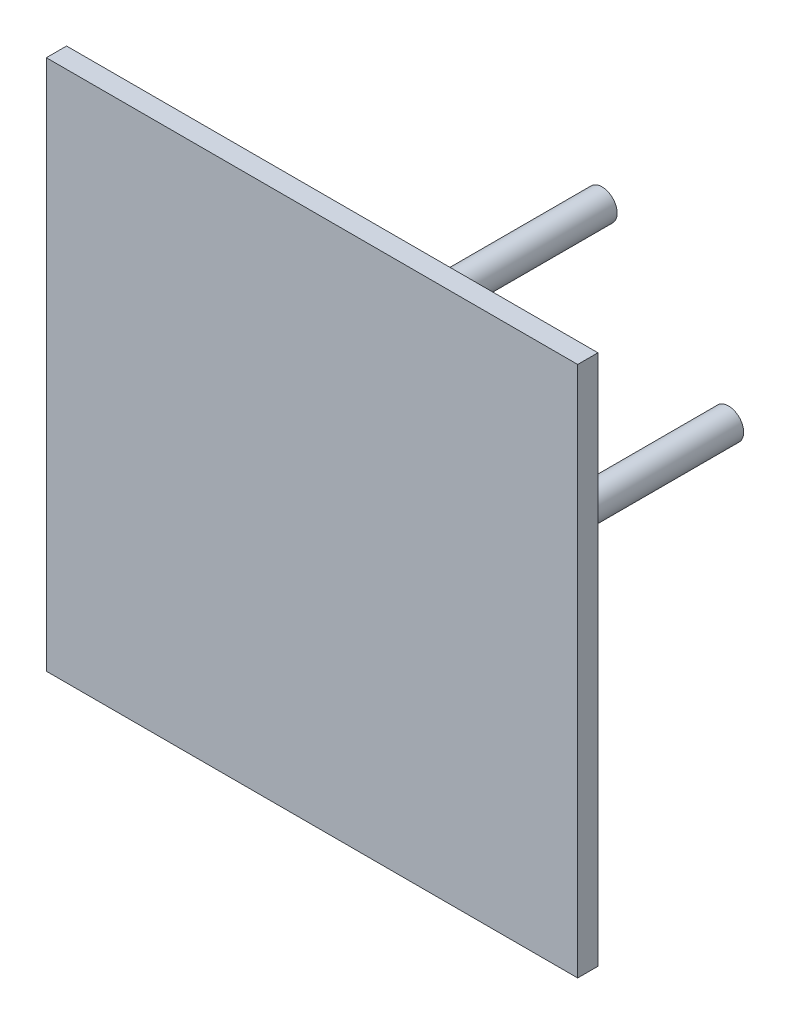
ISO-10303-21;
HEADER;
FILE_DESCRIPTION(('STEP AP214'),'2;1');
FILE_NAME('part.step','',(''),(''),'','','');
FILE_SCHEMA(('AUTOMOTIVE_DESIGN { 1 0 10303 214 1 1 1 1 }'));
ENDSEC;
DATA;
#1=APPLICATION_CONTEXT('core data for automotive mechanical design processes');
#2=APPLICATION_PROTOCOL_DEFINITION('international standard','automotive_design',2000,#1);
#3=PRODUCT_CONTEXT('',#1,'mechanical');
#4=PRODUCT('Part','Part','',(#3));
#5=PRODUCT_RELATED_PRODUCT_CATEGORY('part','',(#4));
#6=PRODUCT_DEFINITION_FORMATION('','',#4);
#7=PRODUCT_DEFINITION_CONTEXT('part definition',#1,'design');
#8=PRODUCT_DEFINITION('design','',#6,#7);
#9=PRODUCT_DEFINITION_SHAPE('','',#8);
#10=(LENGTH_UNIT() NAMED_UNIT(*) SI_UNIT(.MILLI.,.METRE.));
#11=(NAMED_UNIT(*) PLANE_ANGLE_UNIT() SI_UNIT($,.RADIAN.));
#12=(NAMED_UNIT(*) SI_UNIT($,.STERADIAN.) SOLID_ANGLE_UNIT());
#13=UNCERTAINTY_MEASURE_WITH_UNIT(LENGTH_MEASURE(1.E-05),#10,'distance_accuracy_value','');
#14=(GEOMETRIC_REPRESENTATION_CONTEXT(3) GLOBAL_UNCERTAINTY_ASSIGNED_CONTEXT((#13)) GLOBAL_UNIT_ASSIGNED_CONTEXT((#10,
#11,#12)) REPRESENTATION_CONTEXT('',''));
#15=CARTESIAN_POINT('',(0.,0.,0.));
#16=DIRECTION('',(0.,0.,1.));
#17=DIRECTION('',(1.,0.,0.));
#18=AXIS2_PLACEMENT_3D('',#15,#16,#17);
#19=CARTESIAN_POINT('',(77.5,52.5,-53.3));
#20=DIRECTION('',(0.,0.,-1.));
#21=DIRECTION('',(-1.,0.,0.));
#22=AXIS2_PLACEMENT_3D('',#19,#20,#21);
#23=PLANE('',#22);
#24=CARTESIAN_POINT('',(77.5,52.5,-53.3));
#25=DIRECTION('',(0.,0.,1.));
#26=DIRECTION('',(1.,0.,0.));
#27=AXIS2_PLACEMENT_3D('',#24,#25,#26);
#28=CIRCLE('',#27,3.);
#29=CARTESIAN_POINT('',(80.5,52.5,-53.3));
#30=VERTEX_POINT('',#29);
#31=EDGE_CURVE('E188',#30,#30,#28,.T.);
#32=ORIENTED_EDGE('',*,*,#31,.F.);
#33=EDGE_LOOP('',(#32));
#34=FACE_BOUND('',#33,.T.);
#35=ADVANCED_FACE('F17',(#34),#23,.T.);
#36=CARTESIAN_POINT('',(52.5,27.5,-53.3));
#37=DIRECTION('',(0.,0.,-1.));
#38=DIRECTION('',(-1.,0.,0.));
#39=AXIS2_PLACEMENT_3D('',#36,#37,#38);
#40=PLANE('',#39);
#41=CARTESIAN_POINT('',(52.5,27.5,-53.3));
#42=DIRECTION('',(0.,0.,1.));
#43=DIRECTION('',(1.,0.,0.));
#44=AXIS2_PLACEMENT_3D('',#41,#42,#43);
#45=CIRCLE('',#44,3.);
#46=CARTESIAN_POINT('',(55.5,27.5,-53.3));
#47=VERTEX_POINT('',#46);
#48=EDGE_CURVE('E238',#47,#47,#45,.T.);
#49=ORIENTED_EDGE('',*,*,#48,.F.);
#50=EDGE_LOOP('',(#49));
#51=FACE_BOUND('',#50,.T.);
#52=ADVANCED_FACE('F246',(#51),#40,.T.);
#53=CARTESIAN_POINT('',(27.5,52.5,-53.3));
#54=DIRECTION('',(0.,0.,-1.));
#55=DIRECTION('',(-1.,0.,0.));
#56=AXIS2_PLACEMENT_3D('',#53,#54,#55);
#57=PLANE('',#56);
#58=CARTESIAN_POINT('',(27.5,52.5,-53.3));
#59=DIRECTION('',(0.,0.,1.));
#60=DIRECTION('',(1.,0.,0.));
#61=AXIS2_PLACEMENT_3D('',#58,#59,#60);
#62=CIRCLE('',#61,2.99999999999999);
#63=CARTESIAN_POINT('',(30.5,52.5,-53.3));
#64=VERTEX_POINT('',#63);
#65=EDGE_CURVE('E235',#64,#64,#62,.T.);
#66=ORIENTED_EDGE('',*,*,#65,.F.);
#67=EDGE_LOOP('',(#66));
#68=FACE_BOUND('',#67,.T.);
#69=ADVANCED_FACE('F250',(#68),#57,.T.);
#70=CARTESIAN_POINT('',(52.5,77.5,-53.3));
#71=DIRECTION('',(0.,0.,-1.));
#72=DIRECTION('',(-1.,0.,0.));
#73=AXIS2_PLACEMENT_3D('',#70,#71,#72);
#74=PLANE('',#73);
#75=CARTESIAN_POINT('',(52.5,77.5,-53.3));
#76=DIRECTION('',(0.,0.,1.));
#77=DIRECTION('',(1.,0.,0.));
#78=AXIS2_PLACEMENT_3D('',#75,#76,#77);
#79=CIRCLE('',#78,3.);
#80=CARTESIAN_POINT('',(55.5,77.5,-53.3));
#81=VERTEX_POINT('',#80);
#82=EDGE_CURVE('E232',#81,#81,#79,.T.);
#83=ORIENTED_EDGE('',*,*,#82,.F.);
#84=EDGE_LOOP('',(#83));
#85=FACE_BOUND('',#84,.T.);
#86=ADVANCED_FACE('F347',(#85),#74,.T.);
#87=CARTESIAN_POINT('',(52.5,52.5,2.));
#88=DIRECTION('',(0.,0.,-1.));
#89=DIRECTION('',(-1.,0.,0.));
#90=AXIS2_PLACEMENT_3D('',#87,#88,#89);
#91=PLANE('',#90);
#92=CARTESIAN_POINT('',(52.5,52.5,2.));
#93=DIRECTION('',(0.,0.,-1.));
#94=DIRECTION('',(-1.,0.,0.));
#95=AXIS2_PLACEMENT_3D('',#92,#93,#94);
#96=CIRCLE('',#95,3.);
#97=CARTESIAN_POINT('',(49.5,52.5,2.));
#98=VERTEX_POINT('',#97);
#99=EDGE_CURVE('E229',#98,#98,#96,.T.);
#100=ORIENTED_EDGE('',*,*,#99,.T.);
#101=EDGE_LOOP('',(#100));
#102=FACE_BOUND('',#101,.T.);
#103=ADVANCED_FACE('F344',(#102),#91,.T.);
#104=CARTESIAN_POINT('',(41.,52.5,-11.));
#105=DIRECTION('',(0.,-1.,0.));
#106=DIRECTION('',(0.,0.,-1.));
#107=AXIS2_PLACEMENT_3D('',#104,#105,#106);
#108=CYLINDRICAL_SURFACE('',#107,1.);
#109=CARTESIAN_POINT('',(41.,52.,-11.));
#110=DIRECTION('',(0.,-1.,0.));
#111=DIRECTION('',(0.,0.,-1.));
#112=AXIS2_PLACEMENT_3D('',#109,#110,#111);
#113=CIRCLE('',#112,1.);
#114=CARTESIAN_POINT('',(40.,52.,-11.));
#115=VERTEX_POINT('',#114);
#116=CARTESIAN_POINT('',(41.,52.,-12.));
#117=VERTEX_POINT('',#116);
#118=EDGE_CURVE('E163',#115,#117,#113,.T.);
#119=ORIENTED_EDGE('',*,*,#118,.T.);
#120=DIRECTION('',(0.,1.,0.));
#121=VECTOR('',#120,1.);
#122=CARTESIAN_POINT('',(41.,52.5,-12.));
#123=LINE('',#122,#121);
#124=CARTESIAN_POINT('',(41.,50.,-12.));
#125=VERTEX_POINT('',#124);
#126=EDGE_CURVE('E123',#125,#117,#123,.T.);
#127=ORIENTED_EDGE('',*,*,#126,.F.);
#128=CARTESIAN_POINT('',(41.,50.,-11.));
#129=DIRECTION('',(0.,-1.,0.));
#130=DIRECTION('',(0.,0.,-1.));
#131=AXIS2_PLACEMENT_3D('',#128,#129,#130);
#132=CIRCLE('',#131,1.);
#133=CARTESIAN_POINT('',(40.,50.,-11.));
#134=VERTEX_POINT('',#133);
#135=EDGE_CURVE('E20',#125,#134,#132,.F.);
#136=ORIENTED_EDGE('',*,*,#135,.T.);
#137=DIRECTION('',(0.,1.,0.));
#138=VECTOR('',#137,1.);
#139=CARTESIAN_POINT('',(40.,50.,-11.));
#140=LINE('',#139,#138);
#141=EDGE_CURVE('E122',#134,#115,#140,.T.);
#142=ORIENTED_EDGE('',*,*,#141,.T.);
#143=EDGE_LOOP('',(#119,#127,#136,#142));
#144=FACE_BOUND('',#143,.T.);
#145=ADVANCED_FACE('F121',(#144),#108,.T.);
#146=CARTESIAN_POINT('',(43.25,43.,-6.));
#147=DIRECTION('',(0.,1.,0.));
#148=DIRECTION('',(0.,0.,1.));
#149=AXIS2_PLACEMENT_3D('',#146,#147,#148);
#150=CYLINDRICAL_SURFACE('',#149,1.99870195498223);
#151=CARTESIAN_POINT('',(43.25,50.,-6.));
#152=DIRECTION('',(0.,1.,0.));
#153=DIRECTION('',(0.,0.,1.));
#154=AXIS2_PLACEMENT_3D('',#151,#152,#153);
#155=CIRCLE('',#154,1.99870195498223);
#156=CARTESIAN_POINT('',(43.25,50.,-4.00129804501777));
#157=VERTEX_POINT('',#156);
#158=EDGE_CURVE('E147',#157,#157,#155,.F.);
#159=ORIENTED_EDGE('',*,*,#158,.T.);
#160=EDGE_LOOP('',(#159));
#161=FACE_BOUND('',#160,.T.);
#162=CARTESIAN_POINT('',(43.25,52.,-6.));
#163=DIRECTION('',(0.,1.,0.));
#164=DIRECTION('',(0.,0.,1.));
#165=AXIS2_PLACEMENT_3D('',#162,#163,#164);
#166=CIRCLE('',#165,1.99870195498223);
#167=CARTESIAN_POINT('',(43.25,52.,-4.00129804501777));
#168=VERTEX_POINT('',#167);
#169=EDGE_CURVE('E167',#168,#168,#166,.T.);
#170=ORIENTED_EDGE('',*,*,#169,.T.);
#171=EDGE_LOOP('',(#170));
#172=FACE_BOUND('',#171,.T.);
#173=ADVANCED_FACE('F337',(#161,#172),#150,.F.);
#174=CARTESIAN_POINT('',(43.25,43.,-6.));
#175=DIRECTION('',(0.,1.,0.));
#176=DIRECTION('',(0.,0.,1.));
#177=AXIS2_PLACEMENT_3D('',#174,#175,#176);
#178=CYLINDRICAL_SURFACE('',#177,1.99870195498223);
#179=CARTESIAN_POINT('',(43.25,53.,-6.));
#180=DIRECTION('',(0.,1.,0.));
#181=DIRECTION('',(0.,0.,1.));
#182=AXIS2_PLACEMENT_3D('',#179,#180,#181);
#183=CIRCLE('',#182,1.99870195498223);
#184=CARTESIAN_POINT('',(43.25,53.,-4.00129804501777));
#185=VERTEX_POINT('',#184);
#186=EDGE_CURVE('E176',#185,#185,#183,.F.);
#187=ORIENTED_EDGE('',*,*,#186,.T.);
#188=EDGE_LOOP('',(#187));
#189=FACE_BOUND('',#188,.T.);
#190=CARTESIAN_POINT('',(43.25,55.,-6.));
#191=DIRECTION('',(0.,1.,0.));
#192=DIRECTION('',(0.,0.,1.));
#193=AXIS2_PLACEMENT_3D('',#190,#191,#192);
#194=CIRCLE('',#193,1.99870195498223);
#195=CARTESIAN_POINT('',(43.25,55.,-4.00129804501777));
#196=VERTEX_POINT('',#195);
#197=EDGE_CURVE('E216',#196,#196,#194,.T.);
#198=ORIENTED_EDGE('',*,*,#197,.T.);
#199=EDGE_LOOP('',(#198));
#200=FACE_BOUND('',#199,.T.);
#201=ADVANCED_FACE('F333',(#189,#200),#178,.F.);
#202=CARTESIAN_POINT('',(52.5,52.5,-12.));
#203=DIRECTION('',(0.,0.,-1.));
#204=DIRECTION('',(-1.,0.,0.));
#205=AXIS2_PLACEMENT_3D('',#202,#203,#204);
#206=PLANE('',#205);
#207=CARTESIAN_POINT('',(52.5,52.5,-12.));
#208=DIRECTION('',(0.,0.,1.));
#209=DIRECTION('',(1.,0.,0.));
#210=AXIS2_PLACEMENT_3D('',#207,#208,#209);
#211=CIRCLE('',#210,6.50000000000001);
#212=CARTESIAN_POINT('',(46.5,50.,-12.));
#213=VERTEX_POINT('',#212);
#214=CARTESIAN_POINT('',(46.5,55.,-12.));
#215=VERTEX_POINT('',#214);
#216=EDGE_CURVE('E145',#213,#215,#211,.T.);
#217=ORIENTED_EDGE('',*,*,#216,.F.);
#218=DIRECTION('',(1.,0.,0.));
#219=VECTOR('',#218,1.);
#220=CARTESIAN_POINT('',(46.5,50.,-12.));
#221=LINE('',#220,#219);
#222=EDGE_CURVE('E142',#213,#125,#221,.F.);
#223=ORIENTED_EDGE('',*,*,#222,.T.);
#224=ORIENTED_EDGE('',*,*,#126,.T.);
#225=DIRECTION('',(1.,0.,0.));
#226=VECTOR('',#225,1.);
#227=CARTESIAN_POINT('',(49.4405882918443,52.,-12.));
#228=LINE('',#227,#226);
#229=CARTESIAN_POINT('',(49.4405882918443,52.,-12.));
#230=VERTEX_POINT('',#229);
#231=EDGE_CURVE('E134',#117,#230,#228,.T.);
#232=ORIENTED_EDGE('',*,*,#231,.T.);
#233=CARTESIAN_POINT('',(52.5,52.5,-12.));
#234=DIRECTION('',(0.,0.,1.));
#235=DIRECTION('',(1.,0.,0.));
#236=AXIS2_PLACEMENT_3D('',#233,#234,#235);
#237=CIRCLE('',#236,3.09999999999999);
#238=CARTESIAN_POINT('',(49.4405882918443,53.,-12.));
#239=VERTEX_POINT('',#238);
#240=EDGE_CURVE('E171',#230,#239,#237,.T.);
#241=ORIENTED_EDGE('',*,*,#240,.T.);
#242=DIRECTION('',(1.,0.,0.));
#243=VECTOR('',#242,1.);
#244=CARTESIAN_POINT('',(49.4405882918443,53.,-12.));
#245=LINE('',#244,#243);
#246=CARTESIAN_POINT('',(41.,53.,-12.));
#247=VERTEX_POINT('',#246);
#248=EDGE_CURVE('E173',#239,#247,#245,.F.);
#249=ORIENTED_EDGE('',*,*,#248,.T.);
#250=DIRECTION('',(0.,-1.,0.));
#251=VECTOR('',#250,1.);
#252=CARTESIAN_POINT('',(41.,52.5,-12.));
#253=LINE('',#252,#251);
#254=CARTESIAN_POINT('',(41.,55.,-12.));
#255=VERTEX_POINT('',#254);
#256=EDGE_CURVE('E187',#255,#247,#253,.T.);
#257=ORIENTED_EDGE('',*,*,#256,.F.);
#258=DIRECTION('',(1.,0.,0.));
#259=VECTOR('',#258,1.);
#260=CARTESIAN_POINT('',(46.5,55.,-12.));
#261=LINE('',#260,#259);
#262=EDGE_CURVE('E181',#255,#215,#261,.T.);
#263=ORIENTED_EDGE('',*,*,#262,.T.);
#264=EDGE_LOOP('',(#217,#223,#224,#232,#241,#249,#257,#263));
#265=FACE_BOUND('',#264,.T.);
#266=ADVANCED_FACE('F329',(#265),#206,.T.);
#267=CARTESIAN_POINT('',(41.,52.5,-11.));
#268=DIRECTION('',(0.,-1.,0.));
#269=DIRECTION('',(1.,0.,0.));
#270=AXIS2_PLACEMENT_3D('',#267,#268,#269);
#271=CYLINDRICAL_SURFACE('',#270,1.);
#272=CARTESIAN_POINT('',(41.,55.,-11.));
#273=DIRECTION('',(0.,-1.,0.));
#274=DIRECTION('',(1.,0.,0.));
#275=AXIS2_PLACEMENT_3D('',#272,#273,#274);
#276=CIRCLE('',#275,1.);
#277=CARTESIAN_POINT('',(40.,55.,-11.));
#278=VERTEX_POINT('',#277);
#279=EDGE_CURVE('E212',#278,#255,#276,.T.);
#280=ORIENTED_EDGE('',*,*,#279,.T.);
#281=ORIENTED_EDGE('',*,*,#256,.T.);
#282=CARTESIAN_POINT('',(41.,53.,-11.));
#283=DIRECTION('',(0.,-1.,0.));
#284=DIRECTION('',(1.,0.,0.));
#285=AXIS2_PLACEMENT_3D('',#282,#283,#284);
#286=CIRCLE('',#285,1.);
#287=CARTESIAN_POINT('',(40.,53.,-11.));
#288=VERTEX_POINT('',#287);
#289=EDGE_CURVE('E172',#247,#288,#286,.F.);
#290=ORIENTED_EDGE('',*,*,#289,.T.);
#291=DIRECTION('',(0.,1.,0.));
#292=VECTOR('',#291,1.);
#293=CARTESIAN_POINT('',(40.,55.,-11.));
#294=LINE('',#293,#292);
#295=EDGE_CURVE('E180',#288,#278,#294,.T.);
#296=ORIENTED_EDGE('',*,*,#295,.T.);
#297=EDGE_LOOP('',(#280,#281,#290,#296));
#298=FACE_BOUND('',#297,.T.);
#299=ADVANCED_FACE('F325',(#298),#271,.T.);
#300=CARTESIAN_POINT('',(77.5,52.5,-53.3));
#301=DIRECTION('',(0.,0.,1.));
#302=DIRECTION('',(1.,0.,0.));
#303=AXIS2_PLACEMENT_3D('',#300,#301,#302);
#304=CYLINDRICAL_SURFACE('',#303,3.);
#305=CARTESIAN_POINT('',(77.5,52.5,0.));
#306=DIRECTION('',(0.,0.,1.));
#307=DIRECTION('',(1.,0.,0.));
#308=AXIS2_PLACEMENT_3D('',#305,#306,#307);
#309=CIRCLE('',#308,3.);
#310=CARTESIAN_POINT('',(80.5,52.5,0.));
#311=VERTEX_POINT('',#310);
#312=EDGE_CURVE('E209',#311,#311,#309,.T.);
#313=ORIENTED_EDGE('',*,*,#312,.F.);
#314=EDGE_LOOP('',(#313));
#315=FACE_BOUND('',#314,.T.);
#316=ORIENTED_EDGE('',*,*,#31,.T.);
#317=EDGE_LOOP('',(#316));
#318=FACE_BOUND('',#317,.T.);
#319=ADVANCED_FACE('F243',(#315,#318),#304,.T.);
#320=CARTESIAN_POINT('',(52.5,27.5,-53.3));
#321=DIRECTION('',(0.,0.,1.));
#322=DIRECTION('',(1.,0.,0.));
#323=AXIS2_PLACEMENT_3D('',#320,#321,#322);
#324=CYLINDRICAL_SURFACE('',#323,3.);
#325=CARTESIAN_POINT('',(52.5,27.5,0.));
#326=DIRECTION('',(0.,0.,1.));
#327=DIRECTION('',(1.,0.,0.));
#328=AXIS2_PLACEMENT_3D('',#325,#326,#327);
#329=CIRCLE('',#328,3.);
#330=CARTESIAN_POINT('',(55.5,27.5,0.));
#331=VERTEX_POINT('',#330);
#332=EDGE_CURVE('E206',#331,#331,#329,.T.);
#333=ORIENTED_EDGE('',*,*,#332,.F.);
#334=EDGE_LOOP('',(#333));
#335=FACE_BOUND('',#334,.T.);
#336=ORIENTED_EDGE('',*,*,#48,.T.);
#337=EDGE_LOOP('',(#336));
#338=FACE_BOUND('',#337,.T.);
#339=ADVANCED_FACE('F318',(#335,#338),#324,.T.);
#340=CARTESIAN_POINT('',(27.5,52.5,-53.3));
#341=DIRECTION('',(0.,0.,1.));
#342=DIRECTION('',(1.,0.,0.));
#343=AXIS2_PLACEMENT_3D('',#340,#341,#342);
#344=CYLINDRICAL_SURFACE('',#343,2.99999999999999);
#345=CARTESIAN_POINT('',(27.5,52.5,0.));
#346=DIRECTION('',(0.,0.,1.));
#347=DIRECTION('',(1.,0.,0.));
#348=AXIS2_PLACEMENT_3D('',#345,#346,#347);
#349=CIRCLE('',#348,2.99999999999999);
#350=CARTESIAN_POINT('',(30.5,52.5,0.));
#351=VERTEX_POINT('',#350);
#352=EDGE_CURVE('E203',#351,#351,#349,.T.);
#353=ORIENTED_EDGE('',*,*,#352,.F.);
#354=EDGE_LOOP('',(#353));
#355=FACE_BOUND('',#354,.T.);
#356=ORIENTED_EDGE('',*,*,#65,.T.);
#357=EDGE_LOOP('',(#356));
#358=FACE_BOUND('',#357,.T.);
#359=ADVANCED_FACE('F314',(#355,#358),#344,.T.);
#360=CARTESIAN_POINT('',(52.5,77.5,-53.3));
#361=DIRECTION('',(0.,0.,1.));
#362=DIRECTION('',(1.,0.,0.));
#363=AXIS2_PLACEMENT_3D('',#360,#361,#362);
#364=CYLINDRICAL_SURFACE('',#363,3.);
#365=CARTESIAN_POINT('',(52.5,77.5,0.));
#366=DIRECTION('',(0.,0.,1.));
#367=DIRECTION('',(1.,0.,0.));
#368=AXIS2_PLACEMENT_3D('',#365,#366,#367);
#369=CIRCLE('',#368,3.);
#370=CARTESIAN_POINT('',(55.5,77.5,0.));
#371=VERTEX_POINT('',#370);
#372=EDGE_CURVE('E200',#371,#371,#369,.T.);
#373=ORIENTED_EDGE('',*,*,#372,.F.);
#374=EDGE_LOOP('',(#373));
#375=FACE_BOUND('',#374,.T.);
#376=ORIENTED_EDGE('',*,*,#82,.T.);
#377=EDGE_LOOP('',(#376));
#378=FACE_BOUND('',#377,.T.);
#379=ADVANCED_FACE('F310',(#375,#378),#364,.T.);
#380=CARTESIAN_POINT('',(52.5,52.5,2.));
#381=DIRECTION('',(0.,0.,-1.));
#382=DIRECTION('',(-1.,0.,0.));
#383=AXIS2_PLACEMENT_3D('',#380,#381,#382);
#384=CYLINDRICAL_SURFACE('',#383,3.);
#385=CARTESIAN_POINT('',(52.5,52.5,0.));
#386=DIRECTION('',(0.,0.,-1.));
#387=DIRECTION('',(-1.,0.,0.));
#388=AXIS2_PLACEMENT_3D('',#385,#386,#387);
#389=CIRCLE('',#388,3.);
#390=CARTESIAN_POINT('',(49.5,52.5,0.));
#391=VERTEX_POINT('',#390);
#392=EDGE_CURVE('E197',#391,#391,#389,.F.);
#393=ORIENTED_EDGE('',*,*,#392,.F.);
#394=EDGE_LOOP('',(#393));
#395=FACE_BOUND('',#394,.T.);
#396=ORIENTED_EDGE('',*,*,#99,.F.);
#397=EDGE_LOOP('',(#396));
#398=FACE_BOUND('',#397,.T.);
#399=ADVANCED_FACE('F306',(#395,#398),#384,.F.);
#400=CARTESIAN_POINT('',(49.4405882918443,53.,-12.));
#401=DIRECTION('',(0.,1.,0.));
#402=DIRECTION('',(0.,0.,1.));
#403=AXIS2_PLACEMENT_3D('',#400,#401,#402);
#404=PLANE('',#403);
#405=ORIENTED_EDGE('',*,*,#289,.F.);
#406=ORIENTED_EDGE('',*,*,#248,.F.);
#407=DIRECTION('',(0.,0.,1.));
#408=VECTOR('',#407,1.);
#409=CARTESIAN_POINT('',(49.4405882918443,53.,-12.));
#410=LINE('',#409,#408);
#411=CARTESIAN_POINT('',(49.4405882918443,53.,0.));
#412=VERTEX_POINT('',#411);
#413=EDGE_CURVE('E168',#239,#412,#410,.T.);
#414=ORIENTED_EDGE('',*,*,#413,.T.);
#415=DIRECTION('',(-1.,0.,0.));
#416=VECTOR('',#415,1.);
#417=CARTESIAN_POINT('',(0.,53.,0.));
#418=LINE('',#417,#416);
#419=CARTESIAN_POINT('',(40.,53.,0.));
#420=VERTEX_POINT('',#419);
#421=EDGE_CURVE('E196',#420,#412,#418,.F.);
#422=ORIENTED_EDGE('',*,*,#421,.F.);
#423=DIRECTION('',(0.,0.,1.));
#424=VECTOR('',#423,1.);
#425=CARTESIAN_POINT('',(40.,53.,-12.));
#426=LINE('',#425,#424);
#427=EDGE_CURVE('E177',#420,#288,#426,.F.);
#428=ORIENTED_EDGE('',*,*,#427,.T.);
#429=EDGE_LOOP('',(#405,#406,#414,#422,#428));
#430=FACE_BOUND('',#429,.T.);
#431=ORIENTED_EDGE('',*,*,#186,.F.);
#432=EDGE_LOOP('',(#431));
#433=FACE_BOUND('',#432,.T.);
#434=ADVANCED_FACE('F302',(#430,#433),#404,.F.);
#435=CARTESIAN_POINT('',(52.5,52.5,-12.));
#436=DIRECTION('',(0.,0.,1.));
#437=DIRECTION('',(1.,0.,0.));
#438=AXIS2_PLACEMENT_3D('',#435,#436,#437);
#439=CYLINDRICAL_SURFACE('',#438,3.09999999999999);
#440=ORIENTED_EDGE('',*,*,#240,.F.);
#441=DIRECTION('',(0.,0.,-1.));
#442=VECTOR('',#441,1.);
#443=CARTESIAN_POINT('',(49.4405882918443,52.,-12.));
#444=LINE('',#443,#442);
#445=CARTESIAN_POINT('',(49.4405882918443,52.,0.));
#446=VERTEX_POINT('',#445);
#447=EDGE_CURVE('E164',#230,#446,#444,.F.);
#448=ORIENTED_EDGE('',*,*,#447,.T.);
#449=CARTESIAN_POINT('',(52.5,52.5,0.));
#450=DIRECTION('',(0.,0.,1.));
#451=DIRECTION('',(1.,0.,0.));
#452=AXIS2_PLACEMENT_3D('',#449,#450,#451);
#453=CIRCLE('',#452,3.09999999999999);
#454=EDGE_CURVE('E194',#412,#446,#453,.F.);
#455=ORIENTED_EDGE('',*,*,#454,.F.);
#456=ORIENTED_EDGE('',*,*,#413,.F.);
#457=EDGE_LOOP('',(#440,#448,#455,#456));
#458=FACE_BOUND('',#457,.T.);
#459=ADVANCED_FACE('F298',(#458),#439,.F.);
#460=CARTESIAN_POINT('',(49.4405882918443,52.,-12.));
#461=DIRECTION('',(0.,-1.,0.));
#462=DIRECTION('',(0.,0.,-1.));
#463=AXIS2_PLACEMENT_3D('',#460,#461,#462);
#464=PLANE('',#463);
#465=ORIENTED_EDGE('',*,*,#118,.F.);
#466=DIRECTION('',(0.,0.,-1.));
#467=VECTOR('',#466,1.);
#468=CARTESIAN_POINT('',(40.,52.,-12.));
#469=LINE('',#468,#467);
#470=CARTESIAN_POINT('',(40.,52.,0.));
#471=VERTEX_POINT('',#470);
#472=EDGE_CURVE('E133',#115,#471,#469,.F.);
#473=ORIENTED_EDGE('',*,*,#472,.T.);
#474=DIRECTION('',(-1.,0.,0.));
#475=VECTOR('',#474,1.);
#476=CARTESIAN_POINT('',(0.,52.,0.));
#477=LINE('',#476,#475);
#478=EDGE_CURVE('E155',#446,#471,#477,.T.);
#479=ORIENTED_EDGE('',*,*,#478,.F.);
#480=ORIENTED_EDGE('',*,*,#447,.F.);
#481=ORIENTED_EDGE('',*,*,#231,.F.);
#482=EDGE_LOOP('',(#465,#473,#479,#480,#481));
#483=FACE_BOUND('',#482,.T.);
#484=ORIENTED_EDGE('',*,*,#169,.F.);
#485=EDGE_LOOP('',(#484));
#486=FACE_BOUND('',#485,.T.);
#487=ADVANCED_FACE('F295',(#483,#486),#464,.F.);
#488=CARTESIAN_POINT('',(40.,50.,-12.));
#489=DIRECTION('',(1.,0.,0.));
#490=DIRECTION('',(0.,0.,-1.));
#491=AXIS2_PLACEMENT_3D('',#488,#489,#490);
#492=PLANE('',#491);
#493=ORIENTED_EDGE('',*,*,#141,.F.);
#494=DIRECTION('',(0.,0.,1.));
#495=VECTOR('',#494,1.);
#496=CARTESIAN_POINT('',(40.,50.,-12.));
#497=LINE('',#496,#495);
#498=CARTESIAN_POINT('',(40.,50.,0.));
#499=VERTEX_POINT('',#498);
#500=EDGE_CURVE('E130',#134,#499,#497,.T.);
#501=ORIENTED_EDGE('',*,*,#500,.T.);
#502=DIRECTION('',(0.,1.,0.));
#503=VECTOR('',#502,1.);
#504=CARTESIAN_POINT('',(40.,0.,0.));
#505=LINE('',#504,#503);
#506=EDGE_CURVE('E153',#471,#499,#505,.F.);
#507=ORIENTED_EDGE('',*,*,#506,.F.);
#508=ORIENTED_EDGE('',*,*,#472,.F.);
#509=EDGE_LOOP('',(#493,#501,#507,#508));
#510=FACE_BOUND('',#509,.T.);
#511=ADVANCED_FACE('F128',(#510),#492,.F.);
#512=CARTESIAN_POINT('',(46.5,50.,-12.));
#513=DIRECTION('',(0.,1.,0.));
#514=DIRECTION('',(0.,0.,1.));
#515=AXIS2_PLACEMENT_3D('',#512,#513,#514);
#516=PLANE('',#515);
#517=ORIENTED_EDGE('',*,*,#135,.F.);
#518=ORIENTED_EDGE('',*,*,#222,.F.);
#519=DIRECTION('',(0.,0.,1.));
#520=VECTOR('',#519,1.);
#521=CARTESIAN_POINT('',(46.5,50.,-12.));
#522=LINE('',#521,#520);
#523=CARTESIAN_POINT('',(46.5,50.,0.));
#524=VERTEX_POINT('',#523);
#525=EDGE_CURVE('E141',#524,#213,#522,.F.);
#526=ORIENTED_EDGE('',*,*,#525,.F.);
#527=DIRECTION('',(-1.,0.,0.));
#528=VECTOR('',#527,1.);
#529=CARTESIAN_POINT('',(0.,50.,0.));
#530=LINE('',#529,#528);
#531=EDGE_CURVE('E140',#499,#524,#530,.F.);
#532=ORIENTED_EDGE('',*,*,#531,.F.);
#533=ORIENTED_EDGE('',*,*,#500,.F.);
#534=EDGE_LOOP('',(#517,#518,#526,#532,#533));
#535=FACE_BOUND('',#534,.T.);
#536=ORIENTED_EDGE('',*,*,#158,.F.);
#537=EDGE_LOOP('',(#536));
#538=FACE_BOUND('',#537,.T.);
#539=ADVANCED_FACE('F136',(#535,#538),#516,.F.);
#540=CARTESIAN_POINT('',(52.5,52.5,-12.));
#541=DIRECTION('',(0.,0.,1.));
#542=DIRECTION('',(1.,0.,0.));
#543=AXIS2_PLACEMENT_3D('',#540,#541,#542);
#544=CYLINDRICAL_SURFACE('',#543,6.50000000000001);
#545=DIRECTION('',(0.,0.,1.));
#546=VECTOR('',#545,1.);
#547=CARTESIAN_POINT('',(46.5,55.,-12.));
#548=LINE('',#547,#546);
#549=CARTESIAN_POINT('',(46.5,55.,0.));
#550=VERTEX_POINT('',#549);
#551=EDGE_CURVE('E215',#215,#550,#548,.T.);
#552=ORIENTED_EDGE('',*,*,#551,.T.);
#553=CARTESIAN_POINT('',(52.5,52.5,0.));
#554=DIRECTION('',(0.,0.,1.));
#555=DIRECTION('',(1.,0.,0.));
#556=AXIS2_PLACEMENT_3D('',#553,#554,#555);
#557=CIRCLE('',#556,6.50000000000001);
#558=EDGE_CURVE('E191',#524,#550,#557,.T.);
#559=ORIENTED_EDGE('',*,*,#558,.F.);
#560=ORIENTED_EDGE('',*,*,#525,.T.);
#561=ORIENTED_EDGE('',*,*,#216,.T.);
#562=EDGE_LOOP('',(#552,#559,#560,#561));
#563=FACE_BOUND('',#562,.T.);
#564=ADVANCED_FACE('F286',(#563),#544,.T.);
#565=CARTESIAN_POINT('',(46.5,55.,-12.));
#566=DIRECTION('',(0.,-1.,0.));
#567=DIRECTION('',(1.,0.,0.));
#568=AXIS2_PLACEMENT_3D('',#565,#566,#567);
#569=PLANE('',#568);
#570=ORIENTED_EDGE('',*,*,#279,.F.);
#571=DIRECTION('',(0.,0.,1.));
#572=VECTOR('',#571,1.);
#573=CARTESIAN_POINT('',(40.,55.,-12.));
#574=LINE('',#573,#572);
#575=CARTESIAN_POINT('',(40.,55.,0.));
#576=VERTEX_POINT('',#575);
#577=EDGE_CURVE('E186',#278,#576,#574,.T.);
#578=ORIENTED_EDGE('',*,*,#577,.T.);
#579=DIRECTION('',(-1.,0.,0.));
#580=VECTOR('',#579,1.);
#581=CARTESIAN_POINT('',(0.,55.,0.));
#582=LINE('',#581,#580);
#583=EDGE_CURVE('E193',#550,#576,#582,.T.);
#584=ORIENTED_EDGE('',*,*,#583,.F.);
#585=ORIENTED_EDGE('',*,*,#551,.F.);
#586=ORIENTED_EDGE('',*,*,#262,.F.);
#587=EDGE_LOOP('',(#570,#578,#584,#585,#586));
#588=FACE_BOUND('',#587,.T.);
#589=ORIENTED_EDGE('',*,*,#197,.F.);
#590=EDGE_LOOP('',(#589));
#591=FACE_BOUND('',#590,.T.);
#592=ADVANCED_FACE('F282',(#588,#591),#569,.F.);
#593=CARTESIAN_POINT('',(40.,55.,-12.));
#594=DIRECTION('',(1.,0.,0.));
#595=DIRECTION('',(0.,1.,0.));
#596=AXIS2_PLACEMENT_3D('',#593,#594,#595);
#597=PLANE('',#596);
#598=ORIENTED_EDGE('',*,*,#295,.F.);
#599=ORIENTED_EDGE('',*,*,#427,.F.);
#600=DIRECTION('',(0.,1.,0.));
#601=VECTOR('',#600,1.);
#602=CARTESIAN_POINT('',(40.,0.,0.));
#603=LINE('',#602,#601);
#604=EDGE_CURVE('E576',#576,#420,#603,.F.);
#605=ORIENTED_EDGE('',*,*,#604,.F.);
#606=ORIENTED_EDGE('',*,*,#577,.F.);
#607=EDGE_LOOP('',(#598,#599,#605,#606));
#608=FACE_BOUND('',#607,.T.);
#609=ADVANCED_FACE('F278',(#608),#597,.F.);
#610=CARTESIAN_POINT('',(0.,0.,0.));
#611=DIRECTION('',(0.,0.,-1.));
#612=DIRECTION('',(-1.,0.,0.));
#613=AXIS2_PLACEMENT_3D('',#610,#611,#612);
#614=PLANE('',#613);
#615=ORIENTED_EDGE('',*,*,#583,.T.);
#616=ORIENTED_EDGE('',*,*,#604,.T.);
#617=ORIENTED_EDGE('',*,*,#421,.T.);
#618=ORIENTED_EDGE('',*,*,#454,.T.);
#619=ORIENTED_EDGE('',*,*,#478,.T.);
#620=ORIENTED_EDGE('',*,*,#506,.T.);
#621=ORIENTED_EDGE('',*,*,#531,.T.);
#622=ORIENTED_EDGE('',*,*,#558,.T.);
#623=EDGE_LOOP('',(#615,#616,#617,#618,#619,#620,#621,#622));
#624=FACE_BOUND('',#623,.T.);
#625=DIRECTION('',(0.,1.,0.));
#626=VECTOR('',#625,1.);
#627=CARTESIAN_POINT('',(105.,0.,0.));
#628=LINE('',#627,#626);
#629=CARTESIAN_POINT('',(105.,105.,0.));
#630=VERTEX_POINT('',#629);
#631=CARTESIAN_POINT('',(105.,0.,0.));
#632=VERTEX_POINT('',#631);
#633=EDGE_CURVE('E587',#630,#632,#628,.F.);
#634=ORIENTED_EDGE('',*,*,#633,.T.);
#635=DIRECTION('',(1.,0.,0.));
#636=VECTOR('',#635,1.);
#637=CARTESIAN_POINT('',(0.,0.,0.));
#638=LINE('',#637,#636);
#639=CARTESIAN_POINT('',(0.,0.,0.));
#640=VERTEX_POINT('',#639);
#641=EDGE_CURVE('E592',#632,#640,#638,.F.);
#642=ORIENTED_EDGE('',*,*,#641,.T.);
#643=DIRECTION('',(0.,1.,0.));
#644=VECTOR('',#643,1.);
#645=CARTESIAN_POINT('',(0.,0.,0.));
#646=LINE('',#645,#644);
#647=CARTESIAN_POINT('',(0.,105.,0.));
#648=VERTEX_POINT('',#647);
#649=EDGE_CURVE('E598',#640,#648,#646,.T.);
#650=ORIENTED_EDGE('',*,*,#649,.T.);
#651=DIRECTION('',(1.,0.,0.));
#652=VECTOR('',#651,1.);
#653=CARTESIAN_POINT('',(0.,105.,0.));
#654=LINE('',#653,#652);
#655=EDGE_CURVE('E578',#648,#630,#654,.T.);
#656=ORIENTED_EDGE('',*,*,#655,.T.);
#657=EDGE_LOOP('',(#634,#642,#650,#656));
#658=FACE_BOUND('',#657,.T.);
#659=ORIENTED_EDGE('',*,*,#392,.T.);
#660=EDGE_LOOP('',(#659));
#661=FACE_BOUND('',#660,.T.);
#662=ORIENTED_EDGE('',*,*,#372,.T.);
#663=EDGE_LOOP('',(#662));
#664=FACE_BOUND('',#663,.T.);
#665=ORIENTED_EDGE('',*,*,#352,.T.);
#666=EDGE_LOOP('',(#665));
#667=FACE_BOUND('',#666,.T.);
#668=ORIENTED_EDGE('',*,*,#332,.T.);
#669=EDGE_LOOP('',(#668));
#670=FACE_BOUND('',#669,.T.);
#671=ORIENTED_EDGE('',*,*,#312,.T.);
#672=EDGE_LOOP('',(#671));
#673=FACE_BOUND('',#672,.T.);
#674=ADVANCED_FACE('F274',(#624,#658,#661,#664,#667,#670,#673),#614,.T.);
#675=CARTESIAN_POINT('',(0.,105.,4.));
#676=DIRECTION('',(0.,-1.,0.));
#677=DIRECTION('',(0.,0.,-1.));
#678=AXIS2_PLACEMENT_3D('',#675,#676,#677);
#679=PLANE('',#678);
#680=DIRECTION('',(0.,0.,-1.));
#681=VECTOR('',#680,1.);
#682=CARTESIAN_POINT('',(0.,105.,4.));
#683=LINE('',#682,#681);
#684=CARTESIAN_POINT('',(0.,105.,4.));
#685=VERTEX_POINT('',#684);
#686=EDGE_CURVE('E594',#648,#685,#683,.F.);
#687=ORIENTED_EDGE('',*,*,#686,.T.);
#688=DIRECTION('',(-1.,0.,0.));
#689=VECTOR('',#688,1.);
#690=CARTESIAN_POINT('',(0.,105.,4.));
#691=LINE('',#690,#689);
#692=CARTESIAN_POINT('',(105.,105.,4.));
#693=VERTEX_POINT('',#692);
#694=EDGE_CURVE('E601',#685,#693,#691,.F.);
#695=ORIENTED_EDGE('',*,*,#694,.T.);
#696=DIRECTION('',(0.,0.,1.));
#697=VECTOR('',#696,1.);
#698=CARTESIAN_POINT('',(105.,105.,4.));
#699=LINE('',#698,#697);
#700=EDGE_CURVE('E582',#693,#630,#699,.F.);
#701=ORIENTED_EDGE('',*,*,#700,.T.);
#702=ORIENTED_EDGE('',*,*,#655,.F.);
#703=EDGE_LOOP('',(#687,#695,#701,#702));
#704=FACE_BOUND('',#703,.T.);
#705=ADVANCED_FACE('F270',(#704),#679,.F.);
#706=CARTESIAN_POINT('',(105.,0.,4.));
#707=DIRECTION('',(-1.,0.,0.));
#708=DIRECTION('',(0.,0.,1.));
#709=AXIS2_PLACEMENT_3D('',#706,#707,#708);
#710=PLANE('',#709);
#711=ORIENTED_EDGE('',*,*,#700,.F.);
#712=DIRECTION('',(0.,1.,0.));
#713=VECTOR('',#712,1.);
#714=CARTESIAN_POINT('',(105.,0.,4.));
#715=LINE('',#714,#713);
#716=CARTESIAN_POINT('',(105.,0.,4.));
#717=VERTEX_POINT('',#716);
#718=EDGE_CURVE('E604',#693,#717,#715,.F.);
#719=ORIENTED_EDGE('',*,*,#718,.T.);
#720=DIRECTION('',(0.,0.,1.));
#721=VECTOR('',#720,1.);
#722=CARTESIAN_POINT('',(105.,0.,4.));
#723=LINE('',#722,#721);
#724=EDGE_CURVE('E589',#717,#632,#723,.F.);
#725=ORIENTED_EDGE('',*,*,#724,.T.);
#726=ORIENTED_EDGE('',*,*,#633,.F.);
#727=EDGE_LOOP('',(#711,#719,#725,#726));
#728=FACE_BOUND('',#727,.T.);
#729=ADVANCED_FACE('F266',(#728),#710,.F.);
#730=CARTESIAN_POINT('',(0.,0.,4.));
#731=DIRECTION('',(0.,1.,0.));
#732=DIRECTION('',(0.,0.,1.));
#733=AXIS2_PLACEMENT_3D('',#730,#731,#732);
#734=PLANE('',#733);
#735=ORIENTED_EDGE('',*,*,#724,.F.);
#736=DIRECTION('',(-1.,0.,0.));
#737=VECTOR('',#736,1.);
#738=CARTESIAN_POINT('',(0.,0.,4.));
#739=LINE('',#738,#737);
#740=CARTESIAN_POINT('',(0.,0.,4.));
#741=VERTEX_POINT('',#740);
#742=EDGE_CURVE('E26',#717,#741,#739,.T.);
#743=ORIENTED_EDGE('',*,*,#742,.T.);
#744=DIRECTION('',(0.,0.,-1.));
#745=VECTOR('',#744,1.);
#746=CARTESIAN_POINT('',(0.,0.,4.));
#747=LINE('',#746,#745);
#748=EDGE_CURVE('E34',#741,#640,#747,.T.);
#749=ORIENTED_EDGE('',*,*,#748,.T.);
#750=ORIENTED_EDGE('',*,*,#641,.F.);
#751=EDGE_LOOP('',(#735,#743,#749,#750));
#752=FACE_BOUND('',#751,.T.);
#753=ADVANCED_FACE('F260',(#752),#734,.F.);
#754=CARTESIAN_POINT('',(0.,0.,4.));
#755=DIRECTION('',(1.,0.,0.));
#756=DIRECTION('',(0.,0.,-1.));
#757=AXIS2_PLACEMENT_3D('',#754,#755,#756);
#758=PLANE('',#757);
#759=ORIENTED_EDGE('',*,*,#748,.F.);
#760=DIRECTION('',(0.,1.,0.));
#761=VECTOR('',#760,1.);
#762=CARTESIAN_POINT('',(0.,0.,4.));
#763=LINE('',#762,#761);
#764=EDGE_CURVE('E10',#741,#685,#763,.T.);
#765=ORIENTED_EDGE('',*,*,#764,.T.);
#766=ORIENTED_EDGE('',*,*,#686,.F.);
#767=ORIENTED_EDGE('',*,*,#649,.F.);
#768=EDGE_LOOP('',(#759,#765,#766,#767));
#769=FACE_BOUND('',#768,.T.);
#770=ADVANCED_FACE('F254',(#769),#758,.F.);
#771=CARTESIAN_POINT('',(0.,0.,4.));
#772=DIRECTION('',(0.,0.,-1.));
#773=DIRECTION('',(-1.,0.,0.));
#774=AXIS2_PLACEMENT_3D('',#771,#772,#773);
#775=PLANE('',#774);
#776=ORIENTED_EDGE('',*,*,#742,.F.);
#777=ORIENTED_EDGE('',*,*,#718,.F.);
#778=ORIENTED_EDGE('',*,*,#694,.F.);
#779=ORIENTED_EDGE('',*,*,#764,.F.);
#780=EDGE_LOOP('',(#776,#777,#778,#779));
#781=FACE_BOUND('',#780,.T.);
#782=ADVANCED_FACE('F252',(#781),#775,.F.);
#783=CLOSED_SHELL('',(#35,#52,#69,#86,#103,#145,#173,#201,#266,#299,#319,#339,#359,#379,#399,
#434,#459,#487,#511,#539,#564,#592,#609,#674,#705,#729,#753,#770,#782));
#784=MANIFOLD_SOLID_BREP('B1',#783);
#785=ADVANCED_BREP_SHAPE_REPRESENTATION('',(#18,#784),#14);
#786=SHAPE_DEFINITION_REPRESENTATION(#9,#785);
ENDSEC;
END-ISO-10303-21;
